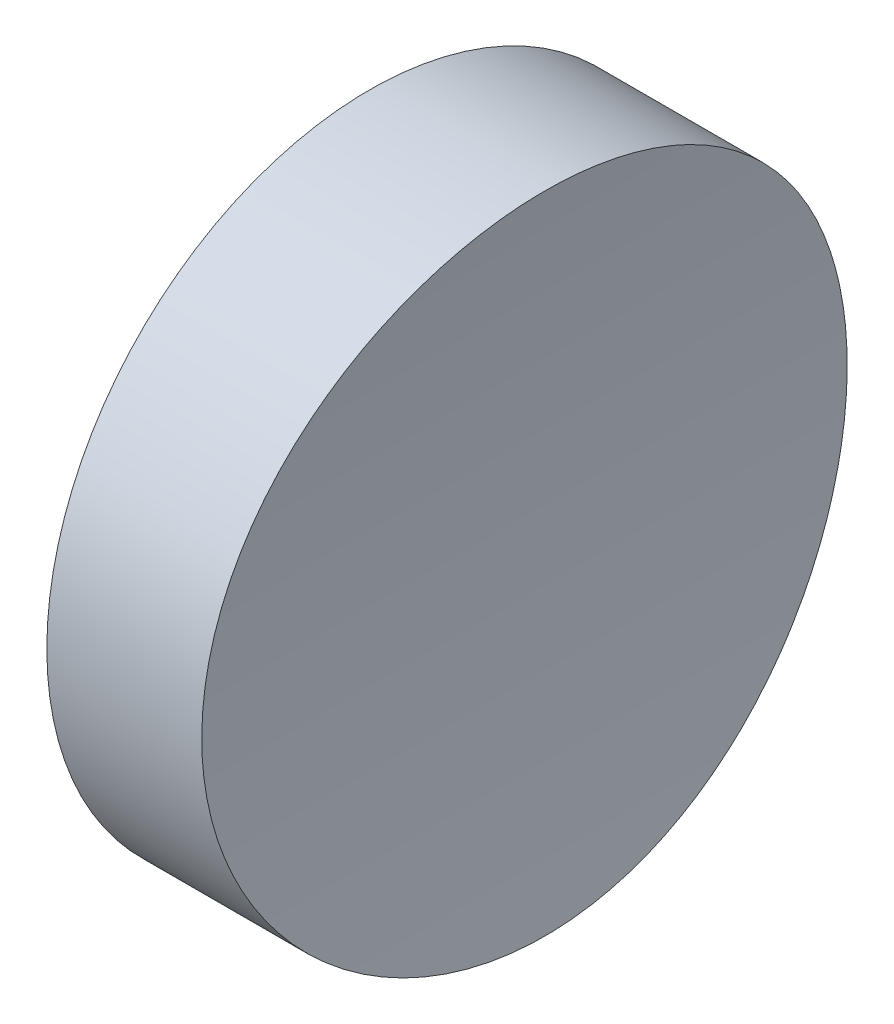
ISO-10303-21;
HEADER;
FILE_DESCRIPTION(('STEP AP214'),'2;1');
FILE_NAME('part.step','',(''),(''),'','','');
FILE_SCHEMA(('AUTOMOTIVE_DESIGN { 1 0 10303 214 1 1 1 1 }'));
ENDSEC;
DATA;
#1=APPLICATION_CONTEXT('core data for automotive mechanical design processes');
#2=APPLICATION_PROTOCOL_DEFINITION('international standard','automotive_design',2000,#1);
#3=PRODUCT_CONTEXT('',#1,'mechanical');
#4=PRODUCT('Part','Part','',(#3));
#5=PRODUCT_RELATED_PRODUCT_CATEGORY('part','',(#4));
#6=PRODUCT_DEFINITION_FORMATION('','',#4);
#7=PRODUCT_DEFINITION_CONTEXT('part definition',#1,'design');
#8=PRODUCT_DEFINITION('design','',#6,#7);
#9=PRODUCT_DEFINITION_SHAPE('','',#8);
#10=(LENGTH_UNIT() NAMED_UNIT(*) SI_UNIT(.MILLI.,.METRE.));
#11=(NAMED_UNIT(*) PLANE_ANGLE_UNIT() SI_UNIT($,.RADIAN.));
#12=(NAMED_UNIT(*) SI_UNIT($,.STERADIAN.) SOLID_ANGLE_UNIT());
#13=UNCERTAINTY_MEASURE_WITH_UNIT(LENGTH_MEASURE(1.E-05),#10,'distance_accuracy_value','');
#14=(GEOMETRIC_REPRESENTATION_CONTEXT(3) GLOBAL_UNCERTAINTY_ASSIGNED_CONTEXT((#13)) GLOBAL_UNIT_ASSIGNED_CONTEXT((#10,
#11,#12)) REPRESENTATION_CONTEXT('',''));
#15=CARTESIAN_POINT('',(0.,0.,0.));
#16=DIRECTION('',(0.,0.,1.));
#17=DIRECTION('',(1.,0.,0.));
#18=AXIS2_PLACEMENT_3D('',#15,#16,#17);
#19=CARTESIAN_POINT('',(10.,0.,0.));
#20=DIRECTION('',(-1.,0.,0.));
#21=DIRECTION('',(0.,0.,1.));
#22=AXIS2_PLACEMENT_3D('',#19,#20,#21);
#23=CYLINDRICAL_SURFACE('',#22,6.25);
#24=CARTESIAN_POINT('',(3.,0.,6.25));
#25=CARTESIAN_POINT('',(2.99999932729531,0.17486264988141,6.25000200680454));
#26=CARTESIAN_POINT('',(3.00091911438067,0.349695840069271,6.24265891316557));
#27=CARTESIAN_POINT('',(3.00457112619082,0.698167683091538,6.21334293466787));
#28=CARTESIAN_POINT('',(3.00730376172519,0.871806056155142,6.19136673379655));
#29=CARTESIAN_POINT('',(3.01450828487551,1.21671821162223,6.13292092945539));
#30=CARTESIAN_POINT('',(3.01898146753249,1.3879901348,6.09644053380669));
#31=CARTESIAN_POINT('',(3.02954260120434,1.72688693599837,6.00924163767552));
#32=CARTESIAN_POINT('',(3.03563114363653,1.8945104538901,5.95851792201508));
#33=CARTESIAN_POINT('',(3.04924376593059,2.22468584941158,5.84327100368695));
#34=CARTESIAN_POINT('',(3.05676633528494,2.38724285598899,5.77876231261219));
#35=CARTESIAN_POINT('',(3.07304336997071,2.70638949214438,5.63635527356306));
#36=CARTESIAN_POINT('',(3.08179828879975,2.8629768978632,5.55845199410803));
#37=CARTESIAN_POINT('',(3.10028800777514,3.16894683367121,5.38987646761822));
#38=CARTESIAN_POINT('',(3.11002226854935,3.31833326335976,5.29921123835918));
#39=CARTESIAN_POINT('',(3.1302069782372,3.60901393981425,5.10568475972976));
#40=CARTESIAN_POINT('',(3.1406576916879,3.75030516183912,5.00281899518832));
#41=CARTESIAN_POINT('',(3.16202932293382,4.02438350855046,4.78514385249439));
#42=CARTESIAN_POINT('',(3.1729521629097,4.15712903782252,4.67028228668928));
#43=CARTESIAN_POINT('',(3.19492013364075,4.41253427474562,4.42976555458967));
#44=CARTESIAN_POINT('',(3.20596530812923,4.53519023415879,4.30410641216351));
#45=CARTESIAN_POINT('',(3.22785909034859,4.7694686097403,4.04294838590132));
#46=CARTESIAN_POINT('',(3.23870775924108,4.8810945088971,3.9074526317909));
#47=CARTESIAN_POINT('',(3.25990949467148,5.09261250622075,3.62747725382448));
#48=CARTESIAN_POINT('',(3.27026237689554,5.19250026036794,3.48299433408552));
#49=CARTESIAN_POINT('',(3.29020426235623,5.38006825952467,3.18564834326277));
#50=CARTESIAN_POINT('',(3.29979087512656,5.46771089536556,3.03276138065916));
#51=CARTESIAN_POINT('',(3.31789381057696,5.62982949762772,2.72002900611881));
#52=CARTESIAN_POINT('',(3.32640973475152,5.70430056582029,2.56018103295227));
#53=CARTESIAN_POINT('',(3.34211758020906,5.83946547351862,2.23476064010075));
#54=CARTESIAN_POINT('',(3.34931002933715,5.90016480790242,2.06919053402172));
#55=CARTESIAN_POINT('',(3.36217068879286,6.00739324508786,1.73344818865727));
#56=CARTESIAN_POINT('',(3.36783833925919,6.05391714391452,1.56327428416321));
#57=CARTESIAN_POINT('',(3.38223037927114,6.1711808545995,1.04958784399827));
#58=CARTESIAN_POINT('',(3.38844743225872,6.22047394635597,0.700829987797434));
#59=CARTESIAN_POINT('',(3.39340227813296,6.2598567136489,0.00013121139921503));
#60=CARTESIAN_POINT('',(3.39214037179019,6.24994876998826,-0.351809580226289));
#61=CARTESIAN_POINT('',(3.38232532347637,6.17153835084882,-1.04699795076385));
#62=CARTESIAN_POINT('',(3.37381383867924,6.10337063717955,-1.39028368237759));
#63=CARTESIAN_POINT('',(3.35052021837612,5.91087722826306,-2.06049133624719));
#64=CARTESIAN_POINT('',(3.33573795582094,5.78655039519991,-2.3874129268071));
#65=CARTESIAN_POINT('',(3.30152204626224,5.48491355801684,-3.01666897972639));
#66=CARTESIAN_POINT('',(3.28207565440442,5.30745804267114,-3.31893297782841));
#67=CARTESIAN_POINT('',(3.24073222954525,4.90470376524444,-3.88951700883965));
#68=CARTESIAN_POINT('',(3.21883508447386,4.67940281482533,-4.15783548826435));
#69=CARTESIAN_POINT('',(3.17487224859552,4.18549775209081,-4.6548567029697));
#70=CARTESIAN_POINT('',(3.15280643921761,3.91660501295583,-4.88327270963727));
#71=CARTESIAN_POINT('',(3.11113418721383,3.34414292942902,-5.29177221985409));
#72=CARTESIAN_POINT('',(3.09152775025907,3.04057350507878,-5.4718556119535));
#73=CARTESIAN_POINT('',(3.05697119423873,2.40715417662496,-5.77857829588452));
#74=CARTESIAN_POINT('',(3.04202263988513,2.07729548785679,-5.90519963338944));
#75=CARTESIAN_POINT('',(3.01848035557493,1.40076985156512,-6.1011762351217));
#76=CARTESIAN_POINT('',(3.00988632811234,1.05410369174296,-6.17053418032197));
#77=CARTESIAN_POINT('',(3.00006008972198,0.356282909618566,-6.24964356067189));
#78=CARTESIAN_POINT('',(2.99877909647363,0.00517372531900025,-6.25978998228802));
#79=CARTESIAN_POINT('',(3.00359154982476,-0.693740091066223,-6.22123066348231));
#80=CARTESIAN_POINT('',(3.00968483937765,-1.04154479336688,-6.17252617638033));
#81=CARTESIAN_POINT('',(3.02853078124918,-1.7228112698469,-6.01797573353669));
#82=CARTESIAN_POINT('',(3.04126148027888,-2.05631642805421,-5.91231811197926));
#83=CARTESIAN_POINT('',(3.07195692186946,-2.70087413515351,-5.64705634973116));
#84=CARTESIAN_POINT('',(3.08992184214841,-3.01192592123623,-5.48745037729689));
#85=CARTESIAN_POINT('',(3.12920442959525,-3.60451130918392,-5.11786723310024));
#86=CARTESIAN_POINT('',(3.15053890772162,-3.88588442778483,-4.90763456305584));
#87=CARTESIAN_POINT('',(3.19412143307392,-4.4094924461394,-4.44312596858315));
#88=CARTESIAN_POINT('',(3.21636951653636,-4.6517257916003,-4.18884829589929));
#89=CARTESIAN_POINT('',(3.25942239641326,-5.09158000188032,-3.64173253769151));
#90=CARTESIAN_POINT('',(3.28021825536876,-5.28893904370931,-3.34868317398833));
#91=CARTESIAN_POINT('',(3.31786460067185,-5.63163183132715,-2.7333503481799));
#92=CARTESIAN_POINT('',(3.33471516610801,-5.77696662004126,-2.41106747227846));
#93=CARTESIAN_POINT('',(3.36250419958137,-6.01106790759924,-1.74732674154748));
#94=CARTESIAN_POINT('',(3.37345808283955,-6.09998201247777,-1.40592148504072));
#95=CARTESIAN_POINT('',(3.38825038993403,-6.21916954108788,-0.712687732995818));
#96=CARTESIAN_POINT('',(3.39208914478503,-6.24944569281599,-0.360859723125625));
#97=CARTESIAN_POINT('',(3.39219826743998,-6.25026504978173,0.16536862539557));
#98=CARTESIAN_POINT('',(3.39130404021255,-6.24319178061111,0.340011531939771));
#99=CARTESIAN_POINT('',(3.38769553857791,-6.21445949803366,0.688056880675981));
#100=CARTESIAN_POINT('',(3.38498194216392,-6.19280591800914,0.861459760648135));
#101=CARTESIAN_POINT('',(3.37780827137805,-6.13505658908522,1.20585879796955));
#102=CARTESIAN_POINT('',(3.37334756182906,-6.09895558760482,1.37685405655987));
#103=CARTESIAN_POINT('',(3.3628106529256,-6.01259732838436,1.71511715467649));
#104=CARTESIAN_POINT('',(3.35673504123678,-5.96234521986165,1.88238632618218));
#105=CARTESIAN_POINT('',(3.34314079654073,-5.84804602544508,2.21208050513683));
#106=CARTESIAN_POINT('',(3.33562216751999,-5.78399897766112,2.37450552596683));
#107=CARTESIAN_POINT('',(3.31935848559845,-5.64259854626254,2.69332132885307));
#108=CARTESIAN_POINT('',(3.31061387811434,-5.56524999298552,2.84971427625704));
#109=CARTESIAN_POINT('',(3.29213964189878,-5.39775107306638,3.15550075986225));
#110=CARTESIAN_POINT('',(3.28240965272367,-5.30759601703144,3.30489170535257));
#111=CARTESIAN_POINT('',(3.26224444749444,-5.11517578135241,3.59553060364154));
#112=CARTESIAN_POINT('',(3.25180948570313,-5.01291495799624,3.73678145862945));
#113=CARTESIAN_POINT('',(3.23044784651044,-4.79620808288634,4.01119290051714));
#114=CARTESIAN_POINT('',(3.21951822301525,-4.6816812657994,4.14428948484251));
#115=CARTESIAN_POINT('',(3.19754912925603,-4.44188850073858,4.40032722504718));
#116=CARTESIAN_POINT('',(3.18650970025173,-4.31662646112227,4.52327204512636));
#117=CARTESIAN_POINT('',(3.16462126133905,-4.05612095971639,4.75827419662147));
#118=CARTESIAN_POINT('',(3.15377237043592,-3.92087151654648,4.87032490905175));
#119=CARTESIAN_POINT('',(3.13258126713343,-3.64145148072077,5.08262796379089));
#120=CARTESIAN_POINT('',(3.12223886905317,-3.49728420188972,5.18288464899322));
#121=CARTESIAN_POINT('',(3.10230583889718,-3.20036625232966,5.37133151917824));
#122=CARTESIAN_POINT('',(3.09271853419251,-3.04758218428092,5.45946944853487));
#123=CARTESIAN_POINT('',(3.0746197632114,-2.73512110918938,5.62251334439789));
#124=CARTESIAN_POINT('',(3.06610790257393,-2.57544665780571,5.69742416526117));
#125=CARTESIAN_POINT('',(3.05040427045803,-2.25040660588946,5.83345352482015));
#126=CARTESIAN_POINT('',(3.04321147001059,-2.08504556195708,5.89458282278232));
#127=CARTESIAN_POINT('',(3.03034396379311,-1.74975252296766,6.00265734644878));
#128=CARTESIAN_POINT('',(3.02466889996921,-1.57982161643017,6.0496059179102));
#129=CARTESIAN_POINT('',(3.01333834651954,-1.17761043469272,6.14261310722837));
#130=CARTESIAN_POINT('',(3.00835738758495,-0.943938622197588,6.18284173989844));
#131=CARTESIAN_POINT('',(3.00168868180295,-0.473493194990547,6.23653372924837));
#132=CARTESIAN_POINT('',(3.00000091067125,-0.236719603164417,6.24999728329649));
#133=CARTESIAN_POINT('',(3.,0.,6.25));
#134=B_SPLINE_CURVE_WITH_KNOTS('',3,(#24,#25,#26,#27,#28,#29,#30,#31,#32,#33,#34,#35,#36,#37,
#38,#39,#40,#41,#42,#43,#44,#45,#46,#47,#48,#49,#50,#51,#52,#53,#54,#55,#56,#57,#58,#59,#60,#61,
#62,#63,#64,#65,#66,#67,#68,#69,#70,#71,#72,#73,#74,#75,#76,#77,#78,#79,#80,#81,#82,#83,#84,#85,
#86,#87,#88,#89,#90,#91,#92,#93,#94,#95,#96,#97,#98,#99,#100,#101,#102,#103,#104,#105,#106,#107,
#108,#109,#110,#111,#112,#113,#114,#115,#116,#117,#118,#119,#120,#121,#122,#123,#124,#125,#126,
#127,#128,#129,#130,#131,#132,#133),.UNSPECIFIED.,.T.,.F.,(4,2,2,2,2,2,2,2,2,2,2,2,2,2,2,2,2,2,
2,2,2,2,2,2,2,2,2,2,2,2,2,2,2,2,2,2,2,2,2,2,2,2,2,2,2,2,2,2,2,2,2,2,2,2,4),(0.,
0.524380797279983,1.04888046510072,1.57377113149825,2.09885423727573,2.62338728174561,
3.14811385849834,3.67255300808731,4.19718685115598,4.72420652899551,5.25142111671214,
5.77846868900779,6.30571069939494,6.8345380441256,7.36356163700194,7.89237377848356,
8.4213798200837,9.47271571482155,10.5240093297801,11.5693024937058,12.6146168368196,
13.6628207398019,14.7110725955045,15.7665720360739,16.8220739104914,17.8779299759537,
18.933736605258,19.9824920674616,21.0312251952117,22.0765114299984,23.1218331596372,
24.1725451558741,25.2232988670407,26.2800343703529,27.336748688202,28.3906869396867,
29.4445761579291,29.9684313675244,30.4920914693767,31.0159421290778,31.5396024189983,
32.0632612622732,32.5867303429578,33.1103916002648,33.6338649864404,34.1610260385257,
34.6879959765561,35.2152841132396,35.7423774757362,36.2716767813171,36.8007814281409,
37.3294715602016,37.8580368571219,38.5679204697118,39.277798847532),.UNSPECIFIED.);
#135=CARTESIAN_POINT('',(3.,0.,6.25));
#136=VERTEX_POINT('',#135);
#137=EDGE_CURVE('E10',#136,#136,#134,.T.);
#138=ORIENTED_EDGE('',*,*,#137,.T.);
#139=EDGE_LOOP('',(#138));
#140=FACE_BOUND('',#139,.T.);
#141=CARTESIAN_POINT('',(0.,0.,0.));
#142=DIRECTION('',(1.,0.,0.));
#143=DIRECTION('',(0.,0.,-1.));
#144=AXIS2_PLACEMENT_3D('',#141,#142,#143);
#145=CIRCLE('',#144,6.25);
#146=CARTESIAN_POINT('',(0.,0.,-6.25));
#147=VERTEX_POINT('',#146);
#148=EDGE_CURVE('E46',#147,#147,#145,.T.);
#149=ORIENTED_EDGE('',*,*,#148,.T.);
#150=EDGE_LOOP('',(#149));
#151=FACE_BOUND('',#150,.T.);
#152=ADVANCED_FACE('F35',(#140,#151),#23,.T.);
#153=CARTESIAN_POINT('',(0.,0.,0.));
#154=DIRECTION('',(1.,0.,0.));
#155=DIRECTION('',(0.,0.,-1.));
#156=AXIS2_PLACEMENT_3D('',#153,#154,#155);
#157=PLANE('',#156);
#158=ORIENTED_EDGE('',*,*,#148,.F.);
#159=EDGE_LOOP('',(#158));
#160=FACE_BOUND('',#159,.T.);
#161=ADVANCED_FACE('F53',(#160),#157,.F.);
#162=CARTESIAN_POINT('',(53.,0.,-6.25));
#163=DIRECTION('',(0.,0.,1.));
#164=DIRECTION('',(1.,0.,0.));
#165=AXIS2_PLACEMENT_3D('',#162,#163,#164);
#166=CYLINDRICAL_SURFACE('',#165,50.);
#167=ORIENTED_EDGE('',*,*,#137,.F.);
#168=EDGE_LOOP('',(#167));
#169=FACE_BOUND('',#168,.T.);
#170=ADVANCED_FACE('F55',(#169),#166,.F.);
#171=CLOSED_SHELL('',(#152,#161,#170));
#172=MANIFOLD_SOLID_BREP('B2',#171);
#173=ADVANCED_BREP_SHAPE_REPRESENTATION('',(#18,#172),#14);
#174=SHAPE_DEFINITION_REPRESENTATION(#9,#173);
ENDSEC;
END-ISO-10303-21;
